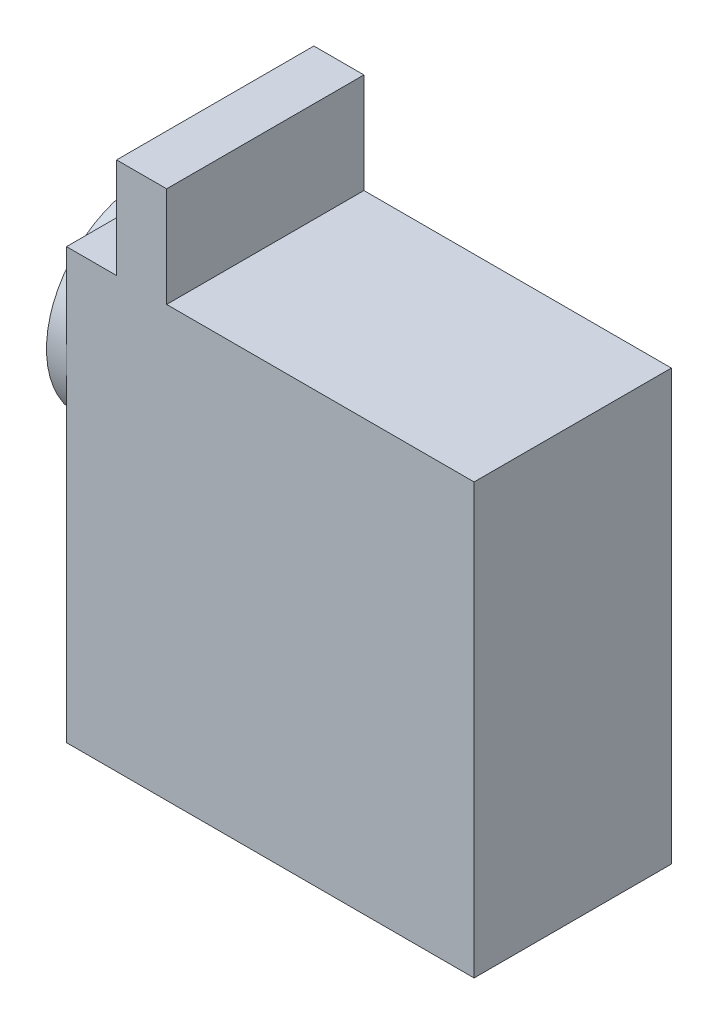
ISO-10303-21;
HEADER;
FILE_DESCRIPTION(('STEP AP214'),'2;1');
FILE_NAME('part.step','',(''),(''),'','','');
FILE_SCHEMA(('AUTOMOTIVE_DESIGN { 1 0 10303 214 1 1 1 1 }'));
ENDSEC;
DATA;
#1=APPLICATION_CONTEXT('core data for automotive mechanical design processes');
#2=APPLICATION_PROTOCOL_DEFINITION('international standard','automotive_design',2000,#1);
#3=PRODUCT_CONTEXT('',#1,'mechanical');
#4=PRODUCT('Part','Part','',(#3));
#5=PRODUCT_RELATED_PRODUCT_CATEGORY('part','',(#4));
#6=PRODUCT_DEFINITION_FORMATION('','',#4);
#7=PRODUCT_DEFINITION_CONTEXT('part definition',#1,'design');
#8=PRODUCT_DEFINITION('design','',#6,#7);
#9=PRODUCT_DEFINITION_SHAPE('','',#8);
#10=(LENGTH_UNIT() NAMED_UNIT(*) SI_UNIT(.MILLI.,.METRE.));
#11=(NAMED_UNIT(*) PLANE_ANGLE_UNIT() SI_UNIT($,.RADIAN.));
#12=(NAMED_UNIT(*) SI_UNIT($,.STERADIAN.) SOLID_ANGLE_UNIT());
#13=UNCERTAINTY_MEASURE_WITH_UNIT(LENGTH_MEASURE(1.E-05),#10,'distance_accuracy_value','');
#14=(GEOMETRIC_REPRESENTATION_CONTEXT(3) GLOBAL_UNCERTAINTY_ASSIGNED_CONTEXT((#13)) GLOBAL_UNIT_ASSIGNED_CONTEXT((#10,
#11,#12)) REPRESENTATION_CONTEXT('',''));
#15=CARTESIAN_POINT('',(0.,0.,0.));
#16=DIRECTION('',(0.,0.,1.));
#17=DIRECTION('',(1.,0.,0.));
#18=AXIS2_PLACEMENT_3D('',#15,#16,#17);
#19=CARTESIAN_POINT('',(-2.,-9.85,9.85));
#20=DIRECTION('',(-1.,0.,0.));
#21=DIRECTION('',(0.,-1.,0.));
#22=AXIS2_PLACEMENT_3D('',#19,#20,#21);
#23=PLANE('',#22);
#24=CARTESIAN_POINT('',(-2.,-9.85,9.85));
#25=DIRECTION('',(-1.,0.,0.));
#26=DIRECTION('',(0.,-1.,0.));
#27=AXIS2_PLACEMENT_3D('',#24,#25,#26);
#28=CIRCLE('',#27,9.85);
#29=CARTESIAN_POINT('',(-2.,-19.7,9.85));
#30=VERTEX_POINT('',#29);
#31=EDGE_CURVE('E128',#30,#30,#28,.T.);
#32=ORIENTED_EDGE('',*,*,#31,.T.);
#33=EDGE_LOOP('',(#32));
#34=FACE_BOUND('',#33,.T.);
#35=CARTESIAN_POINT('',(-2.,-9.85,9.85));
#36=DIRECTION('',(-1.,0.,0.));
#37=DIRECTION('',(0.,-1.,0.));
#38=AXIS2_PLACEMENT_3D('',#35,#36,#37);
#39=CIRCLE('',#38,2.5);
#40=CARTESIAN_POINT('',(-2.,-12.35,9.85));
#41=VERTEX_POINT('',#40);
#42=EDGE_CURVE('E372',#41,#41,#39,.T.);
#43=ORIENTED_EDGE('',*,*,#42,.F.);
#44=EDGE_LOOP('',(#43));
#45=FACE_BOUND('',#44,.T.);
#46=ADVANCED_FACE('F33',(#34,#45),#23,.T.);
#47=CARTESIAN_POINT('',(0.,0.,19.7));
#48=DIRECTION('',(1.,0.,0.));
#49=DIRECTION('',(0.,1.,0.));
#50=AXIS2_PLACEMENT_3D('',#47,#48,#49);
#51=PLANE('',#50);
#52=CARTESIAN_POINT('',(0.,-9.85,9.85));
#53=DIRECTION('',(-1.,0.,0.));
#54=DIRECTION('',(0.,-1.,0.));
#55=AXIS2_PLACEMENT_3D('',#52,#53,#54);
#56=CIRCLE('',#55,9.85);
#57=CARTESIAN_POINT('',(0.,-9.85,19.7));
#58=VERTEX_POINT('',#57);
#59=CARTESIAN_POINT('',(0.,0.,9.85));
#60=VERTEX_POINT('',#59);
#61=EDGE_CURVE('E44',#58,#60,#56,.T.);
#62=ORIENTED_EDGE('',*,*,#61,.F.);
#63=DIRECTION('',(0.,-1.,0.));
#64=VECTOR('',#63,1.);
#65=CARTESIAN_POINT('',(0.,0.,19.7));
#66=LINE('',#65,#64);
#67=CARTESIAN_POINT('',(0.,0.,19.7));
#68=VERTEX_POINT('',#67);
#69=EDGE_CURVE('E108',#68,#58,#66,.T.);
#70=ORIENTED_EDGE('',*,*,#69,.F.);
#71=DIRECTION('',(0.,0.,-1.));
#72=VECTOR('',#71,1.);
#73=CARTESIAN_POINT('',(0.,0.,19.7));
#74=LINE('',#73,#72);
#75=EDGE_CURVE('E126',#68,#60,#74,.T.);
#76=ORIENTED_EDGE('',*,*,#75,.T.);
#77=EDGE_LOOP('',(#62,#70,#76));
#78=FACE_BOUND('',#77,.T.);
#79=ADVANCED_FACE('F35',(#78),#51,.F.);
#80=CARTESIAN_POINT('',(0.,-9.85,0.));
#81=VERTEX_POINT('',#80);
#82=EDGE_CURVE('E11',#60,#81,#56,.T.);
#83=ORIENTED_EDGE('',*,*,#82,.F.);
#84=CARTESIAN_POINT('',(0.,0.,0.));
#85=VERTEX_POINT('',#84);
#86=EDGE_CURVE('E205',#60,#85,#74,.T.);
#87=ORIENTED_EDGE('',*,*,#86,.T.);
#88=DIRECTION('',(0.,-1.,0.));
#89=VECTOR('',#88,1.);
#90=CARTESIAN_POINT('',(0.,0.,0.));
#91=LINE('',#90,#89);
#92=EDGE_CURVE('E179',#85,#81,#91,.T.);
#93=ORIENTED_EDGE('',*,*,#92,.T.);
#94=EDGE_LOOP('',(#83,#87,#93));
#95=FACE_BOUND('',#94,.T.);
#96=ADVANCED_FACE('F232',(#95),#51,.F.);
#97=EDGE_CURVE('E42',#81,#58,#56,.T.);
#98=ORIENTED_EDGE('',*,*,#97,.F.);
#99=CARTESIAN_POINT('',(0.,-42.9,0.));
#100=VERTEX_POINT('',#99);
#101=EDGE_CURVE('E177',#81,#100,#91,.T.);
#102=ORIENTED_EDGE('',*,*,#101,.T.);
#103=DIRECTION('',(0.,0.,-1.));
#104=VECTOR('',#103,1.);
#105=CARTESIAN_POINT('',(0.,-42.9,19.7));
#106=LINE('',#105,#104);
#107=CARTESIAN_POINT('',(0.,-42.9,19.7));
#108=VERTEX_POINT('',#107);
#109=EDGE_CURVE('E123',#108,#100,#106,.T.);
#110=ORIENTED_EDGE('',*,*,#109,.F.);
#111=EDGE_CURVE('E110',#58,#108,#66,.T.);
#112=ORIENTED_EDGE('',*,*,#111,.F.);
#113=EDGE_LOOP('',(#98,#102,#110,#112));
#114=FACE_BOUND('',#113,.T.);
#115=ADVANCED_FACE('F121',(#114),#51,.F.);
#116=CARTESIAN_POINT('',(0.,0.,19.7));
#117=DIRECTION('',(0.,-1.,0.));
#118=DIRECTION('',(0.,0.,-1.));
#119=AXIS2_PLACEMENT_3D('',#116,#117,#118);
#120=PLANE('',#119);
#121=DIRECTION('',(0.,0.,1.));
#122=VECTOR('',#121,1.);
#123=CARTESIAN_POINT('',(5.,0.,0.));
#124=LINE('',#123,#122);
#125=CARTESIAN_POINT('',(5.,0.,0.));
#126=VERTEX_POINT('',#125);
#127=CARTESIAN_POINT('',(5.,0.,19.7));
#128=VERTEX_POINT('',#127);
#129=EDGE_CURVE('E151',#126,#128,#124,.T.);
#130=ORIENTED_EDGE('',*,*,#129,.F.);
#131=DIRECTION('',(-1.,0.,0.));
#132=VECTOR('',#131,1.);
#133=CARTESIAN_POINT('',(0.,0.,0.));
#134=LINE('',#133,#132);
#135=EDGE_CURVE('E190',#126,#85,#134,.T.);
#136=ORIENTED_EDGE('',*,*,#135,.T.);
#137=ORIENTED_EDGE('',*,*,#86,.F.);
#138=ORIENTED_EDGE('',*,*,#75,.F.);
#139=DIRECTION('',(-1.,0.,0.));
#140=VECTOR('',#139,1.);
#141=CARTESIAN_POINT('',(0.,0.,19.7));
#142=LINE('',#141,#140);
#143=EDGE_CURVE('E113',#128,#68,#142,.T.);
#144=ORIENTED_EDGE('',*,*,#143,.F.);
#145=EDGE_LOOP('',(#130,#136,#137,#138,#144));
#146=FACE_BOUND('',#145,.T.);
#147=ADVANCED_FACE('F229',(#146),#120,.F.);
#148=DIRECTION('',(0.,0.,-1.));
#149=VECTOR('',#148,1.);
#150=CARTESIAN_POINT('',(10.,0.,0.));
#151=LINE('',#150,#149);
#152=CARTESIAN_POINT('',(10.,0.,19.7));
#153=VERTEX_POINT('',#152);
#154=CARTESIAN_POINT('',(10.,0.,0.));
#155=VERTEX_POINT('',#154);
#156=EDGE_CURVE('E140',#153,#155,#151,.T.);
#157=ORIENTED_EDGE('',*,*,#156,.F.);
#158=CARTESIAN_POINT('',(40.7,0.,19.7));
#159=VERTEX_POINT('',#158);
#160=EDGE_CURVE('E206',#159,#153,#142,.T.);
#161=ORIENTED_EDGE('',*,*,#160,.F.);
#162=DIRECTION('',(0.,0.,-1.));
#163=VECTOR('',#162,1.);
#164=CARTESIAN_POINT('',(40.7,0.,19.7));
#165=LINE('',#164,#163);
#166=CARTESIAN_POINT('',(40.7,0.,0.));
#167=VERTEX_POINT('',#166);
#168=EDGE_CURVE('E200',#159,#167,#165,.T.);
#169=ORIENTED_EDGE('',*,*,#168,.T.);
#170=EDGE_CURVE('E124',#167,#155,#134,.T.);
#171=ORIENTED_EDGE('',*,*,#170,.T.);
#172=EDGE_LOOP('',(#157,#161,#169,#171));
#173=FACE_BOUND('',#172,.T.);
#174=ADVANCED_FACE('F219',(#173),#120,.F.);
#175=CARTESIAN_POINT('',(0.,-42.9,19.7));
#176=DIRECTION('',(0.,1.,0.));
#177=DIRECTION('',(0.,0.,1.));
#178=AXIS2_PLACEMENT_3D('',#175,#176,#177);
#179=PLANE('',#178);
#180=DIRECTION('',(1.,0.,0.));
#181=VECTOR('',#180,1.);
#182=CARTESIAN_POINT('',(0.,-42.9,0.));
#183=LINE('',#182,#181);
#184=CARTESIAN_POINT('',(40.7,-42.9,0.));
#185=VERTEX_POINT('',#184);
#186=EDGE_CURVE('E182',#100,#185,#183,.T.);
#187=ORIENTED_EDGE('',*,*,#186,.T.);
#188=DIRECTION('',(0.,0.,-1.));
#189=VECTOR('',#188,1.);
#190=CARTESIAN_POINT('',(40.7,-42.9,19.7));
#191=LINE('',#190,#189);
#192=CARTESIAN_POINT('',(40.7,-42.9,19.7));
#193=VERTEX_POINT('',#192);
#194=EDGE_CURVE('E131',#193,#185,#191,.T.);
#195=ORIENTED_EDGE('',*,*,#194,.F.);
#196=DIRECTION('',(1.,0.,0.));
#197=VECTOR('',#196,1.);
#198=CARTESIAN_POINT('',(0.,-42.9,19.7));
#199=LINE('',#198,#197);
#200=EDGE_CURVE('E118',#108,#193,#199,.T.);
#201=ORIENTED_EDGE('',*,*,#200,.F.);
#202=ORIENTED_EDGE('',*,*,#109,.T.);
#203=EDGE_LOOP('',(#187,#195,#201,#202));
#204=FACE_BOUND('',#203,.T.);
#205=ADVANCED_FACE('F215',(#204),#179,.F.);
#206=CARTESIAN_POINT('',(40.7,0.,19.7));
#207=DIRECTION('',(-1.,0.,0.));
#208=DIRECTION('',(0.,-1.,0.));
#209=AXIS2_PLACEMENT_3D('',#206,#207,#208);
#210=PLANE('',#209);
#211=DIRECTION('',(0.,1.,0.));
#212=VECTOR('',#211,1.);
#213=CARTESIAN_POINT('',(40.7,0.,0.));
#214=LINE('',#213,#212);
#215=EDGE_CURVE('E188',#185,#167,#214,.T.);
#216=ORIENTED_EDGE('',*,*,#215,.T.);
#217=ORIENTED_EDGE('',*,*,#168,.F.);
#218=DIRECTION('',(0.,1.,0.));
#219=VECTOR('',#218,1.);
#220=CARTESIAN_POINT('',(40.7,0.,19.7));
#221=LINE('',#220,#219);
#222=EDGE_CURVE('E210',#193,#159,#221,.T.);
#223=ORIENTED_EDGE('',*,*,#222,.F.);
#224=ORIENTED_EDGE('',*,*,#194,.T.);
#225=EDGE_LOOP('',(#216,#217,#223,#224));
#226=FACE_BOUND('',#225,.T.);
#227=ADVANCED_FACE('F218',(#226),#210,.F.);
#228=CARTESIAN_POINT('',(0.,0.,19.7));
#229=DIRECTION('',(0.,0.,1.));
#230=DIRECTION('',(1.,0.,0.));
#231=AXIS2_PLACEMENT_3D('',#228,#229,#230);
#232=PLANE('',#231);
#233=ORIENTED_EDGE('',*,*,#69,.T.);
#234=ORIENTED_EDGE('',*,*,#111,.T.);
#235=ORIENTED_EDGE('',*,*,#200,.T.);
#236=ORIENTED_EDGE('',*,*,#222,.T.);
#237=ORIENTED_EDGE('',*,*,#160,.T.);
#238=DIRECTION('',(0.,-1.,0.));
#239=VECTOR('',#238,1.);
#240=CARTESIAN_POINT('',(10.,10.,19.7));
#241=LINE('',#240,#239);
#242=CARTESIAN_POINT('',(10.,10.,19.7));
#243=VERTEX_POINT('',#242);
#244=EDGE_CURVE('E162',#243,#153,#241,.T.);
#245=ORIENTED_EDGE('',*,*,#244,.F.);
#246=DIRECTION('',(1.,0.,0.));
#247=VECTOR('',#246,1.);
#248=CARTESIAN_POINT('',(5.,10.,19.7));
#249=LINE('',#248,#247);
#250=CARTESIAN_POINT('',(5.,10.,19.7));
#251=VERTEX_POINT('',#250);
#252=EDGE_CURVE('E139',#251,#243,#249,.T.);
#253=ORIENTED_EDGE('',*,*,#252,.F.);
#254=DIRECTION('',(0.,-1.,0.));
#255=VECTOR('',#254,1.);
#256=CARTESIAN_POINT('',(5.,10.,19.7));
#257=LINE('',#256,#255);
#258=EDGE_CURVE('E169',#251,#128,#257,.T.);
#259=ORIENTED_EDGE('',*,*,#258,.T.);
#260=ORIENTED_EDGE('',*,*,#143,.T.);
#261=EDGE_LOOP('',(#233,#234,#235,#236,#237,#245,#253,#259,#260));
#262=FACE_BOUND('',#261,.T.);
#263=ADVANCED_FACE('F109',(#262),#232,.T.);
#264=CARTESIAN_POINT('',(0.,0.,0.));
#265=DIRECTION('',(0.,0.,1.));
#266=DIRECTION('',(1.,0.,0.));
#267=AXIS2_PLACEMENT_3D('',#264,#265,#266);
#268=PLANE('',#267);
#269=ORIENTED_EDGE('',*,*,#92,.F.);
#270=ORIENTED_EDGE('',*,*,#135,.F.);
#271=DIRECTION('',(0.,-1.,0.));
#272=VECTOR('',#271,1.);
#273=CARTESIAN_POINT('',(5.,10.,0.));
#274=LINE('',#273,#272);
#275=CARTESIAN_POINT('',(5.,10.,0.));
#276=VERTEX_POINT('',#275);
#277=EDGE_CURVE('E146',#276,#126,#274,.T.);
#278=ORIENTED_EDGE('',*,*,#277,.F.);
#279=DIRECTION('',(-1.,0.,0.));
#280=VECTOR('',#279,1.);
#281=CARTESIAN_POINT('',(5.,10.,0.));
#282=LINE('',#281,#280);
#283=CARTESIAN_POINT('',(10.,10.,0.));
#284=VERTEX_POINT('',#283);
#285=EDGE_CURVE('E144',#284,#276,#282,.T.);
#286=ORIENTED_EDGE('',*,*,#285,.F.);
#287=DIRECTION('',(0.,-1.,0.));
#288=VECTOR('',#287,1.);
#289=CARTESIAN_POINT('',(10.,10.,0.));
#290=LINE('',#289,#288);
#291=EDGE_CURVE('E157',#284,#155,#290,.T.);
#292=ORIENTED_EDGE('',*,*,#291,.T.);
#293=ORIENTED_EDGE('',*,*,#170,.F.);
#294=ORIENTED_EDGE('',*,*,#215,.F.);
#295=ORIENTED_EDGE('',*,*,#186,.F.);
#296=ORIENTED_EDGE('',*,*,#101,.F.);
#297=EDGE_LOOP('',(#269,#270,#278,#286,#292,#293,#294,#295,#296));
#298=FACE_BOUND('',#297,.T.);
#299=ADVANCED_FACE('F231',(#298),#268,.F.);
#300=CARTESIAN_POINT('',(5.,10.,0.));
#301=DIRECTION('',(1.,0.,0.));
#302=DIRECTION('',(0.,0.,-1.));
#303=AXIS2_PLACEMENT_3D('',#300,#301,#302);
#304=PLANE('',#303);
#305=ORIENTED_EDGE('',*,*,#129,.T.);
#306=ORIENTED_EDGE('',*,*,#258,.F.);
#307=DIRECTION('',(0.,0.,1.));
#308=VECTOR('',#307,1.);
#309=CARTESIAN_POINT('',(5.,10.,0.));
#310=LINE('',#309,#308);
#311=EDGE_CURVE('E136',#276,#251,#310,.T.);
#312=ORIENTED_EDGE('',*,*,#311,.F.);
#313=ORIENTED_EDGE('',*,*,#277,.T.);
#314=EDGE_LOOP('',(#305,#306,#312,#313));
#315=FACE_BOUND('',#314,.T.);
#316=ADVANCED_FACE('F226',(#315),#304,.F.);
#317=CARTESIAN_POINT('',(10.,10.,0.));
#318=DIRECTION('',(-1.,0.,0.));
#319=DIRECTION('',(0.,0.,1.));
#320=AXIS2_PLACEMENT_3D('',#317,#318,#319);
#321=PLANE('',#320);
#322=ORIENTED_EDGE('',*,*,#156,.T.);
#323=ORIENTED_EDGE('',*,*,#291,.F.);
#324=DIRECTION('',(0.,0.,-1.));
#325=VECTOR('',#324,1.);
#326=CARTESIAN_POINT('',(10.,10.,0.));
#327=LINE('',#326,#325);
#328=EDGE_CURVE('E142',#243,#284,#327,.T.);
#329=ORIENTED_EDGE('',*,*,#328,.F.);
#330=ORIENTED_EDGE('',*,*,#244,.T.);
#331=EDGE_LOOP('',(#322,#323,#329,#330));
#332=FACE_BOUND('',#331,.T.);
#333=ADVANCED_FACE('F222',(#332),#321,.F.);
#334=CARTESIAN_POINT('',(0.,10.,0.));
#335=DIRECTION('',(0.,1.,0.));
#336=DIRECTION('',(0.,0.,1.));
#337=AXIS2_PLACEMENT_3D('',#334,#335,#336);
#338=PLANE('',#337);
#339=ORIENTED_EDGE('',*,*,#311,.T.);
#340=ORIENTED_EDGE('',*,*,#252,.T.);
#341=ORIENTED_EDGE('',*,*,#328,.T.);
#342=ORIENTED_EDGE('',*,*,#285,.T.);
#343=EDGE_LOOP('',(#339,#340,#341,#342));
#344=FACE_BOUND('',#343,.T.);
#345=ADVANCED_FACE('F225',(#344),#338,.T.);
#346=CARTESIAN_POINT('',(-2.,-9.85,9.85));
#347=DIRECTION('',(1.,0.,0.));
#348=DIRECTION('',(0.,1.,0.));
#349=AXIS2_PLACEMENT_3D('',#346,#347,#348);
#350=CYLINDRICAL_SURFACE('',#349,9.85);
#351=ORIENTED_EDGE('',*,*,#31,.F.);
#352=EDGE_LOOP('',(#351));
#353=FACE_BOUND('',#352,.T.);
#354=ORIENTED_EDGE('',*,*,#61,.T.);
#355=ORIENTED_EDGE('',*,*,#82,.T.);
#356=ORIENTED_EDGE('',*,*,#97,.T.);
#357=EDGE_LOOP('',(#354,#355,#356));
#358=FACE_BOUND('',#357,.T.);
#359=ADVANCED_FACE('F130',(#353,#358),#350,.T.);
#360=CARTESIAN_POINT('',(-7.,-9.85,9.85));
#361=DIRECTION('',(1.,0.,0.));
#362=DIRECTION('',(0.,1.,0.));
#363=AXIS2_PLACEMENT_3D('',#360,#361,#362);
#364=CYLINDRICAL_SURFACE('',#363,2.5);
#365=CARTESIAN_POINT('',(-7.,-9.85,9.85));
#366=DIRECTION('',(-1.,0.,0.));
#367=DIRECTION('',(0.,-1.,0.));
#368=AXIS2_PLACEMENT_3D('',#365,#366,#367);
#369=CIRCLE('',#368,2.5);
#370=CARTESIAN_POINT('',(-7.,-12.35,9.85));
#371=VERTEX_POINT('',#370);
#372=EDGE_CURVE('E129',#371,#371,#369,.T.);
#373=ORIENTED_EDGE('',*,*,#372,.F.);
#374=EDGE_LOOP('',(#373));
#375=FACE_BOUND('',#374,.T.);
#376=ORIENTED_EDGE('',*,*,#42,.T.);
#377=EDGE_LOOP('',(#376));
#378=FACE_BOUND('',#377,.T.);
#379=ADVANCED_FACE('F247',(#375,#378),#364,.T.);
#380=CARTESIAN_POINT('',(-7.,-9.85,9.85));
#381=DIRECTION('',(-1.,0.,0.));
#382=DIRECTION('',(0.,-1.,0.));
#383=AXIS2_PLACEMENT_3D('',#380,#381,#382);
#384=PLANE('',#383);
#385=ORIENTED_EDGE('',*,*,#372,.T.);
#386=EDGE_LOOP('',(#385));
#387=FACE_BOUND('',#386,.T.);
#388=ADVANCED_FACE('F358',(#387),#384,.T.);
#389=CLOSED_SHELL('',(#46,#79,#96,#115,#147,#174,#205,#227,#263,#299,#316,#333,#345,#359,#379,#388));
#390=MANIFOLD_SOLID_BREP('B2',#389);
#391=ADVANCED_BREP_SHAPE_REPRESENTATION('',(#18,#390),#14);
#392=SHAPE_DEFINITION_REPRESENTATION(#9,#391);
ENDSEC;
END-ISO-10303-21;
